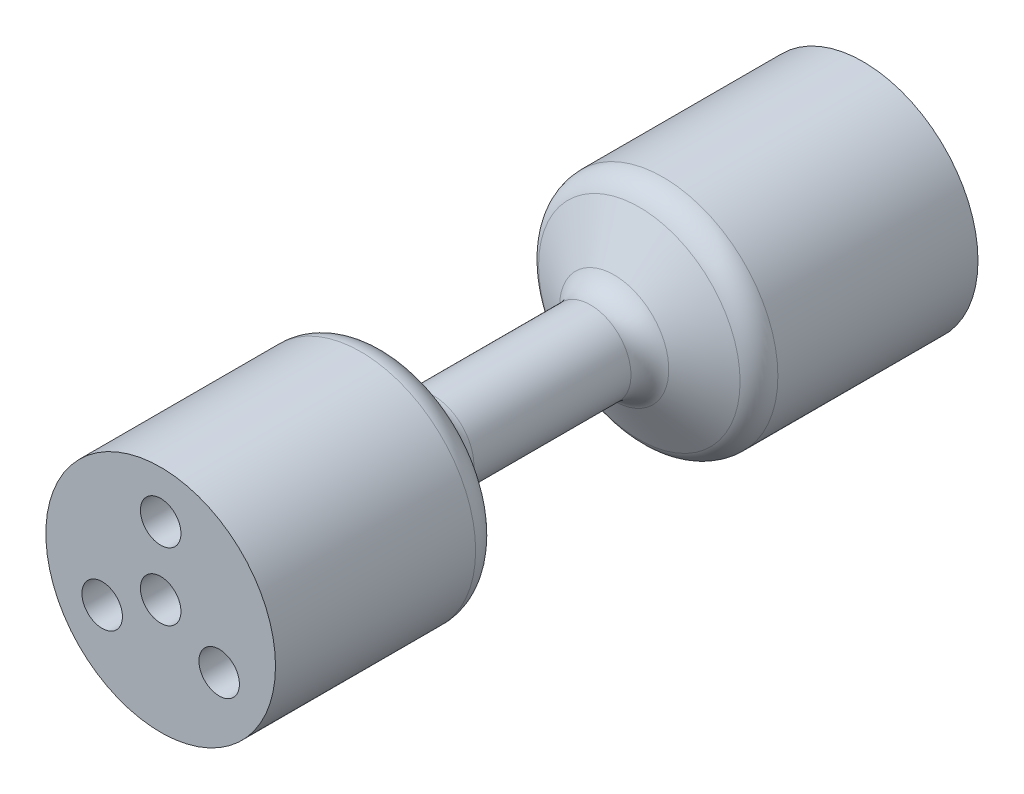
ISO-10303-21;
HEADER;
FILE_DESCRIPTION(('STEP AP214'),'2;1');
FILE_NAME('part.step','',(''),(''),'','','');
FILE_SCHEMA(('AUTOMOTIVE_DESIGN { 1 0 10303 214 1 1 1 1 }'));
ENDSEC;
DATA;
#1=APPLICATION_CONTEXT('core data for automotive mechanical design processes');
#2=APPLICATION_PROTOCOL_DEFINITION('international standard','automotive_design',2000,#1);
#3=PRODUCT_CONTEXT('',#1,'mechanical');
#4=PRODUCT('Part','Part','',(#3));
#5=PRODUCT_RELATED_PRODUCT_CATEGORY('part','',(#4));
#6=PRODUCT_DEFINITION_FORMATION('','',#4);
#7=PRODUCT_DEFINITION_CONTEXT('part definition',#1,'design');
#8=PRODUCT_DEFINITION('design','',#6,#7);
#9=PRODUCT_DEFINITION_SHAPE('','',#8);
#10=(LENGTH_UNIT() NAMED_UNIT(*) SI_UNIT(.MILLI.,.METRE.));
#11=(NAMED_UNIT(*) PLANE_ANGLE_UNIT() SI_UNIT($,.RADIAN.));
#12=(NAMED_UNIT(*) SI_UNIT($,.STERADIAN.) SOLID_ANGLE_UNIT());
#13=UNCERTAINTY_MEASURE_WITH_UNIT(LENGTH_MEASURE(1.E-05),#10,'distance_accuracy_value','');
#14=(GEOMETRIC_REPRESENTATION_CONTEXT(3) GLOBAL_UNCERTAINTY_ASSIGNED_CONTEXT((#13)) GLOBAL_UNIT_ASSIGNED_CONTEXT((#10,
#11,#12)) REPRESENTATION_CONTEXT('',''));
#15=CARTESIAN_POINT('',(0.,0.,0.));
#16=DIRECTION('',(0.,0.,1.));
#17=DIRECTION('',(1.,0.,0.));
#18=AXIS2_PLACEMENT_3D('',#15,#16,#17);
#19=CARTESIAN_POINT('',(0.,0.,-26.));
#20=DIRECTION('',(0.,0.,1.));
#21=DIRECTION('',(1.,0.,0.));
#22=AXIS2_PLACEMENT_3D('',#19,#20,#21);
#23=CYLINDRICAL_SURFACE('',#22,8.5);
#24=CARTESIAN_POINT('',(0.,0.,26.));
#25=DIRECTION('',(0.,0.,1.));
#26=DIRECTION('',(1.,0.,0.));
#27=AXIS2_PLACEMENT_3D('',#24,#25,#26);
#28=CIRCLE('',#27,8.5);
#29=CARTESIAN_POINT('',(8.5,0.,26.));
#30=VERTEX_POINT('',#29);
#31=EDGE_CURVE('E221',#30,#30,#28,.T.);
#32=ORIENTED_EDGE('',*,*,#31,.F.);
#33=EDGE_LOOP('',(#32));
#34=FACE_BOUND('',#33,.T.);
#35=CARTESIAN_POINT('',(0.,0.,11.1872661974803));
#36=DIRECTION('',(0.,0.,1.));
#37=DIRECTION('',(1.,0.,0.));
#38=AXIS2_PLACEMENT_3D('',#35,#36,#37);
#39=CIRCLE('',#38,8.5);
#40=CARTESIAN_POINT('',(8.5,0.,11.1872661974803));
#41=VERTEX_POINT('',#40);
#42=EDGE_CURVE('E12',#41,#41,#39,.T.);
#43=ORIENTED_EDGE('',*,*,#42,.T.);
#44=EDGE_LOOP('',(#43));
#45=FACE_BOUND('',#44,.T.);
#46=CARTESIAN_POINT('',(1.49332949286116,-8.36779343828175,14.7872661974803));
#47=CARTESIAN_POINT('',(1.49320077292687,-8.36781640984236,14.9863625743715));
#48=CARTESIAN_POINT('',(1.45593974164716,-8.37472843837975,15.1771276389204));
#49=CARTESIAN_POINT('',(1.30516877304622,-8.39954590568914,15.5455927399329));
#50=CARTESIAN_POINT('',(1.19836473161887,-8.41628036307572,15.7074170280104));
#51=CARTESIAN_POINT('',(0.918755932610781,-8.45137507842212,15.9885254569623));
#52=CARTESIAN_POINT('',(0.757689252871574,-8.46816872314455,16.0965883343585));
#53=CARTESIAN_POINT('',(0.389886530355396,-8.49305381008551,16.2489604505911));
#54=CARTESIAN_POINT('',(0.199356043893647,-8.49999948653378,16.2870360096817));
#55=CARTESIAN_POINT('',(-0.19931225588046,-8.50000051340983,16.2869652197791));
#56=CARTESIAN_POINT('',(-0.390197353717225,-8.49303207455775,16.2491241653273));
#57=CARTESIAN_POINT('',(-0.757313533559261,-8.46819484932903,16.0965806602115));
#58=CARTESIAN_POINT('',(-0.91849836710609,-8.45140425520101,15.9885532787485));
#59=CARTESIAN_POINT('',(-1.19824843269259,-8.41629810717016,15.7070330614148));
#60=CARTESIAN_POINT('',(-1.30539061251455,-8.39950791598466,15.5449777734616));
#61=CARTESIAN_POINT('',(-1.45539726299671,-8.37481920334952,15.1776054335189));
#62=CARTESIAN_POINT('',(-1.4928785010296,-8.36787391324485,14.9858091621965));
#63=CARTESIAN_POINT('',(-1.49330444006786,-8.36779791200013,14.5884277288241));
#64=CARTESIAN_POINT('',(-1.45567673201202,-8.37477204539171,14.3966217778712));
#65=CARTESIAN_POINT('',(-1.30536339506055,-8.39951355539305,14.0295595219438));
#66=CARTESIAN_POINT('',(-1.19765403300475,-8.41637359716597,13.866917384349));
#67=CARTESIAN_POINT('',(-0.918985706498862,-8.45134219997604,13.586196793426));
#68=CARTESIAN_POINT('',(-0.756746922633022,-8.46823480627482,13.477597953289));
#69=CARTESIAN_POINT('',(-0.390614254837772,-8.49300224555701,13.3257261163328));
#70=CARTESIAN_POINT('',(-0.198439710295903,-8.50000330899419,13.2877109449996));
#71=CARTESIAN_POINT('',(0.198723085159996,-8.499996688644,13.2875242765838));
#72=CARTESIAN_POINT('',(0.390875785371489,-8.49299064598984,13.3258464571734));
#73=CARTESIAN_POINT('',(0.757047614380403,-8.46820836434849,13.4774581621797));
#74=CARTESIAN_POINT('',(0.919017527831042,-8.45134284903115,13.5862341417105));
#75=CARTESIAN_POINT('',(1.12838566918774,-8.42506338692205,13.7968018778415));
#76=CARTESIAN_POINT('',(1.19008827991209,-8.4164501827975,13.8724404576655));
#77=CARTESIAN_POINT('',(1.29743377941897,-8.40057196752214,14.0346162862075));
#78=CARTESIAN_POINT('',(1.34362322320899,-8.39321703271982,14.1224860666553));
#79=CARTESIAN_POINT('',(1.41787072328118,-8.38099386328057,14.3037941695261));
#80=CARTESIAN_POINT('',(1.44589221537894,-8.37614281119899,14.3975183066449));
#81=CARTESIAN_POINT('',(1.48392496216112,-8.36948859840128,14.5916408031886));
#82=CARTESIAN_POINT('',(1.49339385282831,-8.36778195250144,14.6877180090347));
#83=CARTESIAN_POINT('',(1.49332949286116,-8.36779343828175,14.7872661974803));
#84=B_SPLINE_CURVE_WITH_KNOTS('',3,(#46,#47,#48,#49,#50,#51,#52,#53,#54,#55,#56,#57,#58,#59,#60,
#61,#62,#63,#64,#65,#66,#67,#68,#69,#70,#71,#72,#73,#74,#75,#76,#77,#78,#79,#80,#81,#82,#83),
.UNSPECIFIED.,.T.,.F.,(4,2,2,2,2,2,2,2,2,2,2,2,2,2,2,2,2,2,4),(0.,0.0625,0.125,0.1875,0.25,
0.3125,0.375,0.4375,0.5,0.5625,0.625,0.6875,0.75,0.8125,0.875,0.90625,0.9375,0.96875,1.),.UNSPECIFIED.);
#85=CARTESIAN_POINT('',(1.49332949286116,-8.36779343828175,14.7872661974803));
#86=VERTEX_POINT('',#85);
#87=EDGE_CURVE('E224',#86,#86,#84,.T.);
#88=ORIENTED_EDGE('',*,*,#87,.F.);
#89=EDGE_LOOP('',(#88));
#90=FACE_BOUND('',#89,.T.);
#91=ADVANCED_FACE('F157',(#34,#45,#90),#23,.T.);
#92=CARTESIAN_POINT('',(0.,0.,-26.));
#93=DIRECTION('',(0.,0.,1.));
#94=DIRECTION('',(1.,0.,0.));
#95=AXIS2_PLACEMENT_3D('',#92,#93,#94);
#96=CIRCLE('',#95,8.5);
#97=CARTESIAN_POINT('',(8.5,0.,-26.));
#98=VERTEX_POINT('',#97);
#99=EDGE_CURVE('E339',#98,#98,#96,.T.);
#100=ORIENTED_EDGE('',*,*,#99,.T.);
#101=EDGE_LOOP('',(#100));
#102=FACE_BOUND('',#101,.T.);
#103=CARTESIAN_POINT('',(0.,0.,-11.1872661974803));
#104=DIRECTION('',(0.,0.,1.));
#105=DIRECTION('',(1.,0.,0.));
#106=AXIS2_PLACEMENT_3D('',#103,#104,#105);
#107=CIRCLE('',#106,8.5);
#108=CARTESIAN_POINT('',(8.5,0.,-11.1872661974803));
#109=VERTEX_POINT('',#108);
#110=EDGE_CURVE('E342',#109,#109,#107,.F.);
#111=ORIENTED_EDGE('',*,*,#110,.T.);
#112=EDGE_LOOP('',(#111));
#113=FACE_BOUND('',#112,.T.);
#114=CARTESIAN_POINT('',(1.4931181344637,-8.36783115487733,-14.1872661974803));
#115=CARTESIAN_POINT('',(1.49306248216078,-8.36784108522382,-13.9881406986235));
#116=CARTESIAN_POINT('',(1.45555752529808,-8.37479302682736,-13.7967508177317));
#117=CARTESIAN_POINT('',(1.3051868760339,-8.39954124760852,-13.4295661964944));
#118=CARTESIAN_POINT('',(1.19788025343674,-8.41634831881446,-13.267357827716));
#119=CARTESIAN_POINT('',(0.9183898093226,-8.45141386297683,-12.9859851422204));
#120=CARTESIAN_POINT('',(0.75690587087002,-8.4682264536657,-12.877618192523));
#121=CARTESIAN_POINT('',(0.390234251442477,-8.49302555023368,-12.7255029899182));
#122=CARTESIAN_POINT('',(0.198556472236748,-8.50000679898275,-12.6874964215123));
#123=CARTESIAN_POINT('',(-0.199138161238625,-8.49999319106543,-12.6875849993441));
#124=CARTESIAN_POINT('',(-0.390408268486887,-8.49302573907051,-12.7255828696081));
#125=CARTESIAN_POINT('',(-0.757832504296225,-8.46815178867557,-12.8778213233675));
#126=CARTESIAN_POINT('',(-0.919460273273915,-8.45129230384802,-12.9861567180744));
#127=CARTESIAN_POINT('',(-1.19833167059312,-8.41627886933788,-13.2668533059465));
#128=CARTESIAN_POINT('',(-1.3055776650063,-8.39948129862992,-13.4292705030596));
#129=CARTESIAN_POINT('',(-1.41848247320001,-8.38089268840579,-13.7051325834634));
#130=CARTESIAN_POINT('',(-1.44667793222646,-8.37600664633941,-13.798949624178));
#131=CARTESIAN_POINT('',(-1.48428367274597,-8.36942449383067,-13.9903097334339));
#132=CARTESIAN_POINT('',(-1.49369491576316,-8.36772821618084,-14.0893627783874));
#133=CARTESIAN_POINT('',(-1.49376440403705,-8.36771581176592,-14.2851549904718));
#134=CARTESIAN_POINT('',(-1.48416075617528,-8.36944685132175,-14.3830666263401));
#135=CARTESIAN_POINT('',(-1.44607437408106,-8.37611142785818,-14.5767229315726));
#136=CARTESIAN_POINT('',(-1.41848002745862,-8.38089318166385,-14.6693460146397));
#137=CARTESIAN_POINT('',(-1.30552360009611,-8.39949001860388,-14.9453138625382));
#138=CARTESIAN_POINT('',(-1.19833167019202,-8.41627986710815,-15.1075416704383));
#139=CARTESIAN_POINT('',(-0.919341477472461,-8.45130622099767,-15.3884240389793));
#140=CARTESIAN_POINT('',(-0.757590504847613,-8.4681684014545,-15.4968009405692));
#141=CARTESIAN_POINT('',(-0.390629115928727,-8.4930105582306,-15.6489119549535));
#142=CARTESIAN_POINT('',(-0.199250359820964,-8.49999359106147,-15.6869570325963));
#143=CARTESIAN_POINT('',(0.198703174822323,-8.50000640013232,-15.6870263583951));
#144=CARTESIAN_POINT('',(0.390160635733516,-8.49303074441404,-15.6489916187671));
#145=CARTESIAN_POINT('',(0.756999308568397,-8.46821991885338,-15.4968942864123));
#146=CARTESIAN_POINT('',(0.918566551544898,-8.45139298768841,-15.3885030140396));
#147=CARTESIAN_POINT('',(1.12803517812514,-8.42511060001017,-15.1776429445888));
#148=CARTESIAN_POINT('',(1.1897520213265,-8.41649768913825,-15.1019526552277));
#149=CARTESIAN_POINT('',(1.29708777225961,-8.40062536568407,-14.939764877417));
#150=CARTESIAN_POINT('',(1.34321170223919,-8.39328289257041,-14.8520360272821));
#151=CARTESIAN_POINT('',(1.41745632800827,-8.38106395095138,-14.6706965746653));
#152=CARTESIAN_POINT('',(1.44548426344682,-8.3762133551096,-14.577048199622));
#153=CARTESIAN_POINT('',(1.48363111283088,-8.36954082654652,-14.3828253617912));
#154=CARTESIAN_POINT('',(1.49314596061516,-8.36782618970409,-14.2868289469087));
#155=CARTESIAN_POINT('',(1.4931181344637,-8.36783115487733,-14.1872661974803));
#156=B_SPLINE_CURVE_WITH_KNOTS('',3,(#114,#115,#116,#117,#118,#119,#120,#121,#122,#123,#124,
#125,#126,#127,#128,#129,#130,#131,#132,#133,#134,#135,#136,#137,#138,#139,#140,#141,#142,#143,
#144,#145,#146,#147,#148,#149,#150,#151,#152,#153,#154,#155),.UNSPECIFIED.,.T.,.F.,(4,2,2,2,2,2,
2,2,2,2,2,2,2,2,2,2,2,2,2,2,4),(0.,0.0625,0.125,0.1875,0.25,0.3125,0.375,0.4375,0.46875,0.5,
0.53125,0.5625,0.625,0.6875,0.75,0.8125,0.875,0.90625,0.9375,0.96875,1.),.UNSPECIFIED.);
#157=CARTESIAN_POINT('',(1.4931181344637,-8.36783115487733,-14.1872661974803));
#158=VERTEX_POINT('',#157);
#159=EDGE_CURVE('E180',#158,#158,#156,.T.);
#160=ORIENTED_EDGE('',*,*,#159,.F.);
#161=EDGE_LOOP('',(#160));
#162=FACE_BOUND('',#161,.T.);
#163=ADVANCED_FACE('F184',(#102,#113,#162),#23,.T.);
#164=CARTESIAN_POINT('',(0.,0.,26.));
#165=DIRECTION('',(0.,0.,1.));
#166=DIRECTION('',(1.,0.,0.));
#167=AXIS2_PLACEMENT_3D('',#164,#165,#166);
#168=PLANE('',#167);
#169=CARTESIAN_POINT('',(0.,5.,26.));
#170=DIRECTION('',(0.,0.,-1.));
#171=DIRECTION('',(-1.,0.,0.));
#172=AXIS2_PLACEMENT_3D('',#169,#170,#171);
#173=CIRCLE('',#172,1.5);
#174=CARTESIAN_POINT('',(-1.5,5.,26.));
#175=VERTEX_POINT('',#174);
#176=EDGE_CURVE('E388',#175,#175,#173,.T.);
#177=ORIENTED_EDGE('',*,*,#176,.T.);
#178=EDGE_LOOP('',(#177));
#179=FACE_BOUND('',#178,.T.);
#180=CARTESIAN_POINT('',(-4.33012701892251,-2.49999999999982,26.));
#181=DIRECTION('',(0.,0.,-1.));
#182=DIRECTION('',(-1.,0.,0.));
#183=AXIS2_PLACEMENT_3D('',#180,#181,#182);
#184=CIRCLE('',#183,1.50000000000027);
#185=CARTESIAN_POINT('',(-5.83012701892279,-2.49999999999982,26.));
#186=VERTEX_POINT('',#185);
#187=EDGE_CURVE('E392',#186,#186,#184,.T.);
#188=ORIENTED_EDGE('',*,*,#187,.T.);
#189=EDGE_LOOP('',(#188));
#190=FACE_BOUND('',#189,.T.);
#191=CARTESIAN_POINT('',(4.33012701892187,-2.50000000000019,26.));
#192=DIRECTION('',(0.,0.,-1.));
#193=DIRECTION('',(-1.,0.,0.));
#194=AXIS2_PLACEMENT_3D('',#191,#192,#193);
#195=CIRCLE('',#194,1.5000000000004);
#196=CARTESIAN_POINT('',(2.83012701892147,-2.50000000000019,26.));
#197=VERTEX_POINT('',#196);
#198=EDGE_CURVE('E395',#197,#197,#195,.T.);
#199=ORIENTED_EDGE('',*,*,#198,.T.);
#200=EDGE_LOOP('',(#199));
#201=FACE_BOUND('',#200,.T.);
#202=CARTESIAN_POINT('',(0.,0.,26.));
#203=DIRECTION('',(0.,0.,1.));
#204=DIRECTION('',(1.,0.,0.));
#205=AXIS2_PLACEMENT_3D('',#202,#203,#204);
#206=CIRCLE('',#205,1.5);
#207=CARTESIAN_POINT('',(1.5,0.,26.));
#208=VERTEX_POINT('',#207);
#209=EDGE_CURVE('E236',#208,#208,#206,.F.);
#210=ORIENTED_EDGE('',*,*,#209,.T.);
#211=EDGE_LOOP('',(#210));
#212=FACE_BOUND('',#211,.T.);
#213=ORIENTED_EDGE('',*,*,#31,.T.);
#214=EDGE_LOOP('',(#213));
#215=FACE_BOUND('',#214,.T.);
#216=ADVANCED_FACE('F194',(#179,#190,#201,#212,#215),#168,.T.);
#217=CARTESIAN_POINT('',(0.,0.,10.));
#218=DIRECTION('',(0.,0.,1.));
#219=DIRECTION('',(1.,0.,0.));
#220=AXIS2_PLACEMENT_3D('',#217,#218,#219);
#221=CONICAL_SURFACE('',#220,8.5,1.07144960511477);
#222=CARTESIAN_POINT('',(0.,0.,9.43147505165154));
#223=DIRECTION('',(0.,0.,1.));
#224=DIRECTION('',(1.,0.,0.));
#225=AXIS2_PLACEMENT_3D('',#222,#223,#224);
#226=CIRCLE('',#225,7.45770426136115);
#227=CARTESIAN_POINT('',(7.45770426136115,0.,9.43147505165154));
#228=VERTEX_POINT('',#227);
#229=EDGE_CURVE('E167',#228,#228,#226,.F.);
#230=ORIENTED_EDGE('',*,*,#229,.T.);
#231=EDGE_LOOP('',(#230));
#232=FACE_BOUND('',#231,.T.);
#233=CARTESIAN_POINT('',(0.,0.,7.56852494834847));
#234=DIRECTION('',(0.,0.,1.));
#235=DIRECTION('',(1.,0.,0.));
#236=AXIS2_PLACEMENT_3D('',#233,#234,#235);
#237=CIRCLE('',#236,4.04229573863885);
#238=CARTESIAN_POINT('',(4.04229573863885,0.,7.56852494834847));
#239=VERTEX_POINT('',#238);
#240=EDGE_CURVE('E172',#239,#239,#237,.T.);
#241=ORIENTED_EDGE('',*,*,#240,.T.);
#242=EDGE_LOOP('',(#241));
#243=FACE_BOUND('',#242,.T.);
#244=ADVANCED_FACE('F359',(#232,#243),#221,.T.);
#245=CARTESIAN_POINT('',(0.,0.,-7.));
#246=DIRECTION('',(0.,0.,-1.));
#247=DIRECTION('',(-1.,0.,0.));
#248=AXIS2_PLACEMENT_3D('',#245,#246,#247);
#249=CONICAL_SURFACE('',#248,3.,1.07144960511477);
#250=CARTESIAN_POINT('',(0.,0.,-9.43147505165153));
#251=DIRECTION('',(0.,0.,-1.));
#252=DIRECTION('',(-1.,0.,0.));
#253=AXIS2_PLACEMENT_3D('',#250,#251,#252);
#254=CIRCLE('',#253,7.45770426136115);
#255=CARTESIAN_POINT('',(-7.45770426136115,0.,-9.43147505165153));
#256=VERTEX_POINT('',#255);
#257=EDGE_CURVE('E348',#256,#256,#254,.F.);
#258=ORIENTED_EDGE('',*,*,#257,.T.);
#259=EDGE_LOOP('',(#258));
#260=FACE_BOUND('',#259,.T.);
#261=CARTESIAN_POINT('',(0.,0.,-7.56852494834847));
#262=DIRECTION('',(0.,0.,-1.));
#263=DIRECTION('',(-1.,0.,0.));
#264=AXIS2_PLACEMENT_3D('',#261,#262,#263);
#265=CIRCLE('',#264,4.04229573863885);
#266=CARTESIAN_POINT('',(-4.04229573863885,0.,-7.56852494834847));
#267=VERTEX_POINT('',#266);
#268=EDGE_CURVE('E345',#267,#267,#265,.T.);
#269=ORIENTED_EDGE('',*,*,#268,.T.);
#270=EDGE_LOOP('',(#269));
#271=FACE_BOUND('',#270,.T.);
#272=ADVANCED_FACE('F364',(#260,#271),#249,.T.);
#273=CARTESIAN_POINT('',(0.,0.,-22.));
#274=DIRECTION('',(0.,0.,-1.));
#275=DIRECTION('',(-1.,0.,0.));
#276=AXIS2_PLACEMENT_3D('',#273,#274,#275);
#277=CYLINDRICAL_SURFACE('',#276,3.);
#278=CARTESIAN_POINT('',(0.,0.,-5.8127338025197));
#279=DIRECTION('',(0.,0.,-1.));
#280=DIRECTION('',(-1.,0.,0.));
#281=AXIS2_PLACEMENT_3D('',#278,#279,#280);
#282=CIRCLE('',#281,3.);
#283=CARTESIAN_POINT('',(-3.,0.,-5.8127338025197));
#284=VERTEX_POINT('',#283);
#285=EDGE_CURVE('E354',#284,#284,#282,.F.);
#286=ORIENTED_EDGE('',*,*,#285,.T.);
#287=EDGE_LOOP('',(#286));
#288=FACE_BOUND('',#287,.T.);
#289=CARTESIAN_POINT('',(0.,0.,5.8127338025197));
#290=DIRECTION('',(0.,0.,-1.));
#291=DIRECTION('',(-1.,0.,0.));
#292=AXIS2_PLACEMENT_3D('',#289,#290,#291);
#293=CIRCLE('',#292,3.);
#294=CARTESIAN_POINT('',(-3.,0.,5.8127338025197));
#295=VERTEX_POINT('',#294);
#296=EDGE_CURVE('E351',#295,#295,#293,.T.);
#297=ORIENTED_EDGE('',*,*,#296,.T.);
#298=EDGE_LOOP('',(#297));
#299=FACE_BOUND('',#298,.T.);
#300=ADVANCED_FACE('F322',(#288,#299),#277,.T.);
#301=CARTESIAN_POINT('',(0.,0.,-26.));
#302=DIRECTION('',(0.,0.,1.));
#303=DIRECTION('',(1.,0.,0.));
#304=AXIS2_PLACEMENT_3D('',#301,#302,#303);
#305=PLANE('',#304);
#306=CARTESIAN_POINT('',(0.,5.,-26.));
#307=DIRECTION('',(0.,0.,-1.));
#308=DIRECTION('',(-1.,0.,0.));
#309=AXIS2_PLACEMENT_3D('',#306,#307,#308);
#310=CIRCLE('',#309,1.5);
#311=CARTESIAN_POINT('',(-1.5,5.,-26.));
#312=VERTEX_POINT('',#311);
#313=EDGE_CURVE('E406',#312,#312,#310,.T.);
#314=ORIENTED_EDGE('',*,*,#313,.F.);
#315=EDGE_LOOP('',(#314));
#316=FACE_BOUND('',#315,.T.);
#317=CARTESIAN_POINT('',(-4.33012701892251,-2.49999999999982,-26.));
#318=DIRECTION('',(0.,0.,-1.));
#319=DIRECTION('',(-1.,0.,0.));
#320=AXIS2_PLACEMENT_3D('',#317,#318,#319);
#321=CIRCLE('',#320,1.50000000000027);
#322=CARTESIAN_POINT('',(-5.83012701892279,-2.49999999999982,-26.));
#323=VERTEX_POINT('',#322);
#324=EDGE_CURVE('E412',#323,#323,#321,.T.);
#325=ORIENTED_EDGE('',*,*,#324,.F.);
#326=EDGE_LOOP('',(#325));
#327=FACE_BOUND('',#326,.T.);
#328=CARTESIAN_POINT('',(4.33012701892187,-2.50000000000019,-26.));
#329=DIRECTION('',(0.,0.,-1.));
#330=DIRECTION('',(-1.,0.,0.));
#331=AXIS2_PLACEMENT_3D('',#328,#329,#330);
#332=CIRCLE('',#331,1.5000000000004);
#333=CARTESIAN_POINT('',(2.83012701892147,-2.50000000000019,-26.));
#334=VERTEX_POINT('',#333);
#335=EDGE_CURVE('E417',#334,#334,#332,.T.);
#336=ORIENTED_EDGE('',*,*,#335,.F.);
#337=EDGE_LOOP('',(#336));
#338=FACE_BOUND('',#337,.T.);
#339=CARTESIAN_POINT('',(0.,0.,-26.));
#340=DIRECTION('',(0.,0.,-1.));
#341=DIRECTION('',(-1.,0.,0.));
#342=AXIS2_PLACEMENT_3D('',#339,#340,#341);
#343=CIRCLE('',#342,1.5);
#344=CARTESIAN_POINT('',(-1.5,0.,-26.));
#345=VERTEX_POINT('',#344);
#346=EDGE_CURVE('E243',#345,#345,#343,.T.);
#347=ORIENTED_EDGE('',*,*,#346,.F.);
#348=EDGE_LOOP('',(#347));
#349=FACE_BOUND('',#348,.T.);
#350=ORIENTED_EDGE('',*,*,#99,.F.);
#351=EDGE_LOOP('',(#350));
#352=FACE_BOUND('',#351,.T.);
#353=ADVANCED_FACE('F196',(#316,#327,#338,#349,#352),#305,.F.);
#354=CARTESIAN_POINT('',(0.,0.,-11.1872661974803));
#355=DIRECTION('',(0.,0.,1.));
#356=DIRECTION('',(1.,0.,0.));
#357=AXIS2_PLACEMENT_3D('',#354,#355,#356);
#358=TOROIDAL_SURFACE('',#357,6.5,2.);
#359=ORIENTED_EDGE('',*,*,#257,.F.);
#360=EDGE_LOOP('',(#359));
#361=FACE_BOUND('',#360,.T.);
#362=ORIENTED_EDGE('',*,*,#110,.F.);
#363=EDGE_LOOP('',(#362));
#364=FACE_BOUND('',#363,.T.);
#365=ADVANCED_FACE('F198',(#361,#364),#358,.T.);
#366=CARTESIAN_POINT('',(0.,0.,-5.8127338025197));
#367=DIRECTION('',(0.,0.,-1.));
#368=DIRECTION('',(-1.,0.,0.));
#369=AXIS2_PLACEMENT_3D('',#366,#367,#368);
#370=TOROIDAL_SURFACE('',#369,5.,2.);
#371=ORIENTED_EDGE('',*,*,#285,.F.);
#372=EDGE_LOOP('',(#371));
#373=FACE_BOUND('',#372,.T.);
#374=ORIENTED_EDGE('',*,*,#268,.F.);
#375=EDGE_LOOP('',(#374));
#376=FACE_BOUND('',#375,.T.);
#377=ADVANCED_FACE('F202',(#373,#376),#370,.F.);
#378=CARTESIAN_POINT('',(0.,0.,11.1872661974803));
#379=DIRECTION('',(0.,0.,1.));
#380=DIRECTION('',(1.,0.,0.));
#381=AXIS2_PLACEMENT_3D('',#378,#379,#380);
#382=TOROIDAL_SURFACE('',#381,6.5,2.);
#383=ORIENTED_EDGE('',*,*,#42,.F.);
#384=EDGE_LOOP('',(#383));
#385=FACE_BOUND('',#384,.T.);
#386=ORIENTED_EDGE('',*,*,#229,.F.);
#387=EDGE_LOOP('',(#386));
#388=FACE_BOUND('',#387,.T.);
#389=ADVANCED_FACE('F205',(#385,#388),#382,.T.);
#390=CARTESIAN_POINT('',(0.,0.,5.8127338025197));
#391=DIRECTION('',(0.,0.,-1.));
#392=DIRECTION('',(-1.,0.,0.));
#393=AXIS2_PLACEMENT_3D('',#390,#391,#392);
#394=TOROIDAL_SURFACE('',#393,5.,2.);
#395=ORIENTED_EDGE('',*,*,#240,.F.);
#396=EDGE_LOOP('',(#395));
#397=FACE_BOUND('',#396,.T.);
#398=ORIENTED_EDGE('',*,*,#296,.F.);
#399=EDGE_LOOP('',(#398));
#400=FACE_BOUND('',#399,.T.);
#401=ADVANCED_FACE('F159',(#397,#400),#394,.F.);
#402=CARTESIAN_POINT('',(1.4931181344637,-8.36783115487733,-14.1872661974803));
#403=CARTESIAN_POINT('',(1.49306248216078,-8.36784108522382,-13.9881406986235));
#404=CARTESIAN_POINT('',(1.45555752529808,-8.37479302682736,-13.7967508177317));
#405=CARTESIAN_POINT('',(1.3051868760339,-8.39954124760852,-13.4295661964944));
#406=CARTESIAN_POINT('',(1.19788025343674,-8.41634831881446,-13.267357827716));
#407=CARTESIAN_POINT('',(0.9183898093226,-8.45141386297683,-12.9859851422204));
#408=CARTESIAN_POINT('',(0.75690587087002,-8.4682264536657,-12.877618192523));
#409=CARTESIAN_POINT('',(0.390234251442477,-8.49302555023368,-12.7255029899182));
#410=CARTESIAN_POINT('',(0.198556472236748,-8.50000679898275,-12.6874964215123));
#411=CARTESIAN_POINT('',(-0.199138161238625,-8.49999319106543,-12.6875849993441));
#412=CARTESIAN_POINT('',(-0.390408268486887,-8.49302573907051,-12.7255828696081));
#413=CARTESIAN_POINT('',(-0.757832504296225,-8.46815178867557,-12.8778213233675));
#414=CARTESIAN_POINT('',(-0.919460273273915,-8.45129230384802,-12.9861567180744));
#415=CARTESIAN_POINT('',(-1.19833167059312,-8.41627886933788,-13.2668533059465));
#416=CARTESIAN_POINT('',(-1.3055776650063,-8.39948129862992,-13.4292705030596));
#417=CARTESIAN_POINT('',(-1.41848247320001,-8.38089268840579,-13.7051325834634));
#418=CARTESIAN_POINT('',(-1.44667793222646,-8.37600664633941,-13.798949624178));
#419=CARTESIAN_POINT('',(-1.48428367274597,-8.36942449383067,-13.9903097334339));
#420=CARTESIAN_POINT('',(-1.49369491576316,-8.36772821618084,-14.0893627783874));
#421=CARTESIAN_POINT('',(-1.49376440403705,-8.36771581176592,-14.2851549904718));
#422=CARTESIAN_POINT('',(-1.48416075617528,-8.36944685132175,-14.3830666263401));
#423=CARTESIAN_POINT('',(-1.44607437408106,-8.37611142785818,-14.5767229315726));
#424=CARTESIAN_POINT('',(-1.41848002745862,-8.38089318166385,-14.6693460146397));
#425=CARTESIAN_POINT('',(-1.30552360009611,-8.39949001860388,-14.9453138625382));
#426=CARTESIAN_POINT('',(-1.19833167019202,-8.41627986710815,-15.1075416704383));
#427=CARTESIAN_POINT('',(-0.919341477472461,-8.45130622099767,-15.3884240389793));
#428=CARTESIAN_POINT('',(-0.757590504847613,-8.4681684014545,-15.4968009405692));
#429=CARTESIAN_POINT('',(-0.390629115928727,-8.4930105582306,-15.6489119549535));
#430=CARTESIAN_POINT('',(-0.199250359820964,-8.49999359106147,-15.6869570325963));
#431=CARTESIAN_POINT('',(0.198703174822323,-8.50000640013232,-15.6870263583951));
#432=CARTESIAN_POINT('',(0.390160635733516,-8.49303074441404,-15.6489916187671));
#433=CARTESIAN_POINT('',(0.756999308568397,-8.46821991885338,-15.4968942864123));
#434=CARTESIAN_POINT('',(0.918566551544898,-8.45139298768841,-15.3885030140396));
#435=CARTESIAN_POINT('',(1.12803517812514,-8.42511060001017,-15.1776429445888));
#436=CARTESIAN_POINT('',(1.1897520213265,-8.41649768913825,-15.1019526552277));
#437=CARTESIAN_POINT('',(1.29708777225961,-8.40062536568407,-14.939764877417));
#438=CARTESIAN_POINT('',(1.34321170223919,-8.39328289257041,-14.8520360272821));
#439=CARTESIAN_POINT('',(1.41745632800827,-8.38106395095138,-14.6706965746653));
#440=CARTESIAN_POINT('',(1.44548426344682,-8.3762133551096,-14.577048199622));
#441=CARTESIAN_POINT('',(1.48363111283088,-8.36954082654652,-14.3828253617912));
#442=CARTESIAN_POINT('',(1.49314596061516,-8.36782618970409,-14.2868289469087));
#443=CARTESIAN_POINT('',(1.4931181344637,-8.36783115487733,-14.1872661974803));
#444=CARTESIAN_POINT('',(0.966135263476509,-5.41447898256769,-14.1872661974803));
#445=CARTESIAN_POINT('',(0.966099253162855,-5.414485408086,-13.9881406986235));
#446=CARTESIAN_POINT('',(0.941831339898756,-5.41898372324123,-13.7967508177317));
#447=CARTESIAN_POINT('',(0.844532684492521,-5.43499727786434,-13.4295661964944));
#448=CARTESIAN_POINT('',(0.775098987517894,-5.44587244158582,-13.267357827716));
#449=CARTESIAN_POINT('',(0.594252229561682,-5.46856191133795,-12.9859851422204));
#450=CARTESIAN_POINT('',(0.48976262232766,-5.47944064648957,-12.877618192523));
#451=CARTESIAN_POINT('',(0.25250451563925,-5.49548712073944,-12.7255029899182));
#452=CARTESIAN_POINT('',(0.128477717329661,-5.50000439934178,-12.6874964215123));
#453=CARTESIAN_POINT('',(-0.128854104330875,-5.49999559421881,-12.6875849993441));
#454=CARTESIAN_POINT('',(-0.25261711490328,-5.49548724292798,-12.7255828696081));
#455=CARTESIAN_POINT('',(-0.490362208662263,-5.47939233384889,-12.8778213233675));
#456=CARTESIAN_POINT('',(-0.594944882706651,-5.46848325543107,-12.9861567180744));
#457=CARTESIAN_POINT('',(-0.775391080972019,-5.44582750368922,-13.2668533059465));
#458=CARTESIAN_POINT('',(-0.844785547945256,-5.43495848734877,-13.4292705030596));
#459=CARTESIAN_POINT('',(-0.917841600305891,-5.4229305630861,-13.7051325834634));
#460=CARTESIAN_POINT('',(-0.936085720852418,-5.41976900645491,-13.798949624178));
#461=CARTESIAN_POINT('',(-0.960418847070919,-5.41550996659631,-13.9903097334339));
#462=CARTESIAN_POINT('',(-0.966508474905572,-5.41441237517583,-14.0893627783874));
#463=CARTESIAN_POINT('',(-0.966553437906324,-5.41440434878972,-14.2851549904718));
#464=CARTESIAN_POINT('',(-0.9603393128193,-5.41552443320819,-14.3830666263401));
#465=CARTESIAN_POINT('',(-0.935695183228924,-5.41983680626118,-14.5767229315726));
#466=CARTESIAN_POINT('',(-0.91784001776734,-5.42293088225308,-14.6693460146397));
#467=CARTESIAN_POINT('',(-0.844750564768068,-5.43496412968486,-14.9453138625382));
#468=CARTESIAN_POINT('',(-0.775391080712483,-5.44582814930527,-15.1075416704383));
#469=CARTESIAN_POINT('',(-0.594868014835122,-5.46849226064555,-15.3884240389793));
#470=CARTESIAN_POINT('',(-0.49020562078375,-5.47940308329408,-15.4968009405692));
#471=CARTESIAN_POINT('',(-0.252760016189176,-5.49547742003156,-15.6489119549535));
#472=CARTESIAN_POINT('',(-0.128926703413565,-5.49999585303977,-15.6869570325963));
#473=CARTESIAN_POINT('',(0.128572642532092,-5.50000414126209,-15.6870263583951));
#474=CARTESIAN_POINT('',(0.252456881945216,-5.49549048167967,-15.6489916187671));
#475=CARTESIAN_POINT('',(0.489823082014845,-5.47943641808159,-15.4968942864123));
#476=CARTESIAN_POINT('',(0.59436659217611,-5.46854840379839,-15.3885030140396));
#477=CARTESIAN_POINT('',(0.72990511525744,-5.45154215294776,-15.1776429445888));
#478=CARTESIAN_POINT('',(0.769839543211262,-5.44596909297181,-15.1019526552277));
#479=CARTESIAN_POINT('',(0.839292087932688,-5.43569876603087,-14.939764877417));
#480=CARTESIAN_POINT('',(0.869136983801831,-5.43094775401615,-14.8520360272821));
#481=CARTESIAN_POINT('',(0.917177624005349,-5.42304138002737,-14.6706965746653));
#482=CARTESIAN_POINT('',(0.935313346936177,-5.41990275918857,-14.577048199622));
#483=CARTESIAN_POINT('',(0.959996602419979,-5.41558524070657,-14.3828253617912));
#484=CARTESIAN_POINT('',(0.966153268633336,-5.41447576980853,-14.2868289469087));
#485=CARTESIAN_POINT('',(0.966135263476509,-5.41447898256769,-14.1872661974803));
#486=B_SPLINE_SURFACE_WITH_KNOTS('',1,3,((#402,#403,#404,#405,#406,#407,#408,#409,#410,#411,
#412,#413,#414,#415,#416,#417,#418,#419,#420,#421,#422,#423,#424,#425,#426,#427,#428,#429,#430,
#431,#432,#433,#434,#435,#436,#437,#438,#439,#440,#441,#442,#443),(#444,#445,#446,#447,#448,
#449,#450,#451,#452,#453,#454,#455,#456,#457,#458,#459,#460,#461,#462,#463,#464,#465,#466,#467,
#468,#469,#470,#471,#472,#473,#474,#475,#476,#477,#478,#479,#480,#481,#482,#483,#484,#485)),
.UNSPECIFIED.,.F.,.T.,.F.,(2,2),(4,2,2,2,2,2,2,2,2,2,2,2,2,2,2,2,2,2,2,2,4),(0.,1.),(0.,0.0625,
0.125,0.1875,0.25,0.3125,0.375,0.4375,0.46875,0.5,0.53125,0.5625,0.625,0.6875,0.75,0.8125,0.875,
0.90625,0.9375,0.96875,1.),.UNSPECIFIED.);
#487=CARTESIAN_POINT('',(0.966135263476509,-5.41447898256769,-14.1872661974803));
#488=CARTESIAN_POINT('',(0.966153268633336,-5.41447576980853,-14.2868289469087));
#489=CARTESIAN_POINT('',(0.959996602419979,-5.41558524070657,-14.3828253617912));
#490=CARTESIAN_POINT('',(0.935313346936177,-5.41990275918857,-14.577048199622));
#491=CARTESIAN_POINT('',(0.917177624005349,-5.42304138002737,-14.6706965746653));
#492=CARTESIAN_POINT('',(0.869136983801831,-5.43094775401615,-14.8520360272821));
#493=CARTESIAN_POINT('',(0.839292087932688,-5.43569876603087,-14.939764877417));
#494=CARTESIAN_POINT('',(0.769839543211262,-5.44596909297181,-15.1019526552277));
#495=CARTESIAN_POINT('',(0.72990511525744,-5.45154215294776,-15.1776429445888));
#496=CARTESIAN_POINT('',(0.59436659217611,-5.46854840379839,-15.3885030140396));
#497=CARTESIAN_POINT('',(0.489823082014845,-5.47943641808159,-15.4968942864123));
#498=CARTESIAN_POINT('',(0.252456881945216,-5.49549048167967,-15.6489916187671));
#499=CARTESIAN_POINT('',(0.128572642532092,-5.50000414126209,-15.6870263583951));
#500=CARTESIAN_POINT('',(-0.128926703413565,-5.49999585303977,-15.6869570325963));
#501=CARTESIAN_POINT('',(-0.252760016189176,-5.49547742003156,-15.6489119549535));
#502=CARTESIAN_POINT('',(-0.49020562078375,-5.47940308329408,-15.4968009405692));
#503=CARTESIAN_POINT('',(-0.594868014835122,-5.46849226064555,-15.3884240389793));
#504=CARTESIAN_POINT('',(-0.775391080712483,-5.44582814930527,-15.1075416704383));
#505=CARTESIAN_POINT('',(-0.844750564768068,-5.43496412968486,-14.9453138625382));
#506=CARTESIAN_POINT('',(-0.91784001776734,-5.42293088225308,-14.6693460146397));
#507=CARTESIAN_POINT('',(-0.935695183228924,-5.41983680626118,-14.5767229315726));
#508=CARTESIAN_POINT('',(-0.9603393128193,-5.41552443320819,-14.3830666263401));
#509=CARTESIAN_POINT('',(-0.966553437906324,-5.41440434878972,-14.2851549904718));
#510=CARTESIAN_POINT('',(-0.966508474905572,-5.41441237517583,-14.0893627783874));
#511=CARTESIAN_POINT('',(-0.960418847070919,-5.41550996659631,-13.9903097334339));
#512=CARTESIAN_POINT('',(-0.936085720852418,-5.41976900645491,-13.798949624178));
#513=CARTESIAN_POINT('',(-0.917841600305891,-5.4229305630861,-13.7051325834634));
#514=CARTESIAN_POINT('',(-0.844785547945256,-5.43495848734877,-13.4292705030596));
#515=CARTESIAN_POINT('',(-0.775391080972019,-5.44582750368922,-13.2668533059465));
#516=CARTESIAN_POINT('',(-0.594944882706651,-5.46848325543107,-12.9861567180744));
#517=CARTESIAN_POINT('',(-0.490362208662263,-5.47939233384889,-12.8778213233675));
#518=CARTESIAN_POINT('',(-0.25261711490328,-5.49548724292798,-12.7255828696081));
#519=CARTESIAN_POINT('',(-0.128854104330875,-5.49999559421881,-12.6875849993441));
#520=CARTESIAN_POINT('',(0.128477717329661,-5.50000439934178,-12.6874964215123));
#521=CARTESIAN_POINT('',(0.25250451563925,-5.49548712073944,-12.7255029899182));
#522=CARTESIAN_POINT('',(0.48976262232766,-5.47944064648957,-12.877618192523));
#523=CARTESIAN_POINT('',(0.594252229561682,-5.46856191133795,-12.9859851422204));
#524=CARTESIAN_POINT('',(0.775098987517894,-5.44587244158582,-13.267357827716));
#525=CARTESIAN_POINT('',(0.844532684492521,-5.43499727786434,-13.4295661964944));
#526=CARTESIAN_POINT('',(0.941831339898756,-5.41898372324123,-13.7967508177317));
#527=CARTESIAN_POINT('',(0.966099253162855,-5.414485408086,-13.9881406986235));
#528=CARTESIAN_POINT('',(0.966135263476509,-5.41447898256769,-14.1872661974803));
#529=B_SPLINE_CURVE_WITH_KNOTS('',3,(#487,#488,#489,#490,#491,#492,#493,#494,#495,#496,#497,
#498,#499,#500,#501,#502,#503,#504,#505,#506,#507,#508,#509,#510,#511,#512,#513,#514,#515,#516,
#517,#518,#519,#520,#521,#522,#523,#524,#525,#526,#527,#528),.UNSPECIFIED.,.T.,.F.,(4,2,2,2,2,2,
2,2,2,2,2,2,2,2,2,2,2,2,2,2,4),(0.,0.03125,0.0625,0.09375,0.125,0.1875,0.25,0.3125,0.375,0.4375,
0.46875,0.5,0.53125,0.5625,0.625,0.6875,0.75,0.8125,0.875,0.9375,1.),.UNSPECIFIED.);
#530=CARTESIAN_POINT('',(0.966135263476509,-5.41447898256769,-14.1872661974803));
#531=VERTEX_POINT('',#530);
#532=EDGE_CURVE('E228',#531,#531,#529,.F.);
#533=ORIENTED_EDGE('',*,*,#159,.T.);
#534=EDGE_LOOP('',(#533));
#535=FACE_BOUND('',#534,.T.);
#536=ORIENTED_EDGE('',*,*,#532,.F.);
#537=EDGE_LOOP('',(#536));
#538=FACE_BOUND('',#537,.T.);
#539=ADVANCED_FACE('F212',(#535,#538),#486,.F.);
#540=CARTESIAN_POINT('',(0.,0.,-26.));
#541=DIRECTION('',(0.,0.,1.));
#542=DIRECTION('',(1.,0.,0.));
#543=AXIS2_PLACEMENT_3D('',#540,#541,#542);
#544=CYLINDRICAL_SURFACE('',#543,5.5);
#545=ORIENTED_EDGE('',*,*,#532,.T.);
#546=EDGE_LOOP('',(#545));
#547=FACE_BOUND('',#546,.T.);
#548=ADVANCED_FACE('F274',(#547),#544,.T.);
#549=CARTESIAN_POINT('',(1.49332949286116,-8.36779343828175,14.7872661974803));
#550=CARTESIAN_POINT('',(1.49320077292687,-8.36781640984236,14.9863625743715));
#551=CARTESIAN_POINT('',(1.45593974164716,-8.37472843837975,15.1771276389204));
#552=CARTESIAN_POINT('',(1.30516877304622,-8.39954590568914,15.5455927399329));
#553=CARTESIAN_POINT('',(1.19836473161887,-8.41628036307572,15.7074170280104));
#554=CARTESIAN_POINT('',(0.918755932610781,-8.45137507842212,15.9885254569623));
#555=CARTESIAN_POINT('',(0.757689252871574,-8.46816872314455,16.0965883343585));
#556=CARTESIAN_POINT('',(0.389886530355396,-8.49305381008551,16.2489604505911));
#557=CARTESIAN_POINT('',(0.199356043893647,-8.49999948653378,16.2870360096817));
#558=CARTESIAN_POINT('',(-0.19931225588046,-8.50000051340983,16.2869652197791));
#559=CARTESIAN_POINT('',(-0.390197353717225,-8.49303207455775,16.2491241653273));
#560=CARTESIAN_POINT('',(-0.757313533559261,-8.46819484932903,16.0965806602115));
#561=CARTESIAN_POINT('',(-0.91849836710609,-8.45140425520101,15.9885532787485));
#562=CARTESIAN_POINT('',(-1.19824843269259,-8.41629810717016,15.7070330614148));
#563=CARTESIAN_POINT('',(-1.30539061251455,-8.39950791598466,15.5449777734616));
#564=CARTESIAN_POINT('',(-1.45539726299671,-8.37481920334952,15.1776054335189));
#565=CARTESIAN_POINT('',(-1.4928785010296,-8.36787391324485,14.9858091621965));
#566=CARTESIAN_POINT('',(-1.49330444006786,-8.36779791200013,14.5884277288241));
#567=CARTESIAN_POINT('',(-1.45567673201202,-8.37477204539171,14.3966217778712));
#568=CARTESIAN_POINT('',(-1.30536339506055,-8.39951355539305,14.0295595219438));
#569=CARTESIAN_POINT('',(-1.19765403300475,-8.41637359716597,13.866917384349));
#570=CARTESIAN_POINT('',(-0.918985706498862,-8.45134219997604,13.586196793426));
#571=CARTESIAN_POINT('',(-0.756746922633022,-8.46823480627482,13.477597953289));
#572=CARTESIAN_POINT('',(-0.390614254837772,-8.49300224555701,13.3257261163328));
#573=CARTESIAN_POINT('',(-0.198439710295903,-8.50000330899419,13.2877109449996));
#574=CARTESIAN_POINT('',(0.198723085159996,-8.499996688644,13.2875242765838));
#575=CARTESIAN_POINT('',(0.390875785371489,-8.49299064598984,13.3258464571734));
#576=CARTESIAN_POINT('',(0.757047614380403,-8.46820836434849,13.4774581621797));
#577=CARTESIAN_POINT('',(0.919017527831042,-8.45134284903115,13.5862341417105));
#578=CARTESIAN_POINT('',(1.12838566918774,-8.42506338692205,13.7968018778415));
#579=CARTESIAN_POINT('',(1.19008827991209,-8.4164501827975,13.8724404576655));
#580=CARTESIAN_POINT('',(1.29743377941897,-8.40057196752214,14.0346162862075));
#581=CARTESIAN_POINT('',(1.34362322320899,-8.39321703271982,14.1224860666553));
#582=CARTESIAN_POINT('',(1.41787072328118,-8.38099386328057,14.3037941695261));
#583=CARTESIAN_POINT('',(1.44589221537894,-8.37614281119899,14.3975183066449));
#584=CARTESIAN_POINT('',(1.48392496216112,-8.36948859840128,14.5916408031886));
#585=CARTESIAN_POINT('',(1.49339385282831,-8.36778195250144,14.6877180090347));
#586=CARTESIAN_POINT('',(1.49332949286116,-8.36779343828175,14.7872661974803));
#587=CARTESIAN_POINT('',(0.966272024792516,-5.41445457771172,14.7872661974803));
#588=CARTESIAN_POINT('',(0.966188735423267,-5.41446944166271,14.9863625743715));
#589=CARTESIAN_POINT('',(0.942078656359924,-5.41894193071631,15.1771276389204));
#590=CARTESIAN_POINT('',(0.844520970794612,-5.4350002919165,15.5455927399329));
#591=CARTESIAN_POINT('',(0.775412473400444,-5.44582847022547,15.7074170280104));
#592=CARTESIAN_POINT('',(0.594489132865799,-5.46853681544961,15.9885254569623));
#593=CARTESIAN_POINT('',(0.490269516563959,-5.47940329144647,16.0965883343585));
#594=CARTESIAN_POINT('',(0.252279519641727,-5.49550540652592,16.2489604505911));
#595=CARTESIAN_POINT('',(0.128995087225301,-5.49999966775715,16.2870360096817));
#596=CARTESIAN_POINT('',(-0.128966753805003,-5.50000033220636,16.2869652197791));
#597=CARTESIAN_POINT('',(-0.252480640640557,-5.4954913423609,16.2491241653273));
#598=CARTESIAN_POINT('',(-0.490026404067757,-5.47942019662467,16.0965806602115));
#599=CARTESIAN_POINT('',(-0.594322472833352,-5.46855569454183,15.9885532787485));
#600=CARTESIAN_POINT('',(-0.775337221154026,-5.44583995169834,15.7070330614148));
#601=CARTESIAN_POINT('',(-0.844664513980002,-5.43497571034302,15.5449777734616));
#602=CARTESIAN_POINT('',(-0.941727640762578,-5.41900066099086,15.1776054335189));
#603=CARTESIAN_POINT('',(-0.965980206548564,-5.41450664974667,14.9858091621965));
#604=CARTESIAN_POINT('',(-0.966255814161555,-5.41445747247067,14.5884277288241));
#605=CARTESIAN_POINT('',(-0.941908473654835,-5.41897014701817,14.3966217778712));
#606=CARTESIAN_POINT('',(-0.844646902686235,-5.43497935937198,14.0295595219438));
#607=CARTESIAN_POINT('',(-0.77495260959131,-5.44588879816622,13.866917384349));
#608=CARTESIAN_POINT('',(-0.594637810087499,-5.46851554116097,13.586196793426));
#609=CARTESIAN_POINT('',(-0.489659773468426,-5.479446051119,13.477597953289));
#610=CARTESIAN_POINT('',(-0.252750400189147,-5.49547204124277,13.3257261163328));
#611=CARTESIAN_POINT('',(-0.128402165485585,-5.50000214111389,13.2877109449996));
#612=CARTESIAN_POINT('',(0.128585525691762,-5.49999785735788,13.2875242765838));
#613=CARTESIAN_POINT('',(0.252919625828611,-5.49546453564049,13.3258464571734));
#614=CARTESIAN_POINT('',(0.489854338716732,-5.47942894163726,13.4774581621797));
#615=CARTESIAN_POINT('',(0.594658400361263,-5.4685159611378,13.5862341417105));
#616=CARTESIAN_POINT('',(0.730131903592066,-5.4515116033025,13.7968018778415));
#617=CARTESIAN_POINT('',(0.770057122296059,-5.44593835357485,13.8724404576655));
#618=CARTESIAN_POINT('',(0.839515974918158,-5.43566421427903,14.0346162862075));
#619=CARTESIAN_POINT('',(0.869403262076407,-5.4309051388187,14.1224860666553));
#620=CARTESIAN_POINT('',(0.917445762123118,-5.42299602918155,14.3037941695261));
#621=CARTESIAN_POINT('',(0.935577315833433,-5.41985711312876,14.3975183066449));
#622=CARTESIAN_POINT('',(0.9601867402219,-5.41555144602436,14.5916408031886));
#623=CARTESIAN_POINT('',(0.966313669477141,-5.41444714573622,14.6877180090347));
#624=CARTESIAN_POINT('',(0.966272024792516,-5.41445457771172,14.7872661974803));
#625=B_SPLINE_SURFACE_WITH_KNOTS('',1,3,((#549,#550,#551,#552,#553,#554,#555,#556,#557,#558,
#559,#560,#561,#562,#563,#564,#565,#566,#567,#568,#569,#570,#571,#572,#573,#574,#575,#576,#577,
#578,#579,#580,#581,#582,#583,#584,#585,#586),(#587,#588,#589,#590,#591,#592,#593,#594,#595,
#596,#597,#598,#599,#600,#601,#602,#603,#604,#605,#606,#607,#608,#609,#610,#611,#612,#613,#614,
#615,#616,#617,#618,#619,#620,#621,#622,#623,#624)),.UNSPECIFIED.,.F.,.T.,.F.,(2,2),(4,2,2,2,2,
2,2,2,2,2,2,2,2,2,2,2,2,2,4),(0.,1.),(0.,0.0625,0.125,0.1875,0.25,0.3125,0.375,0.4375,0.5,
0.5625,0.625,0.6875,0.75,0.8125,0.875,0.90625,0.9375,0.96875,1.),.UNSPECIFIED.);
#626=CARTESIAN_POINT('',(0.966272024792516,-5.41445457771172,14.7872661974803));
#627=CARTESIAN_POINT('',(0.966313669477141,-5.41444714573622,14.6877180090347));
#628=CARTESIAN_POINT('',(0.9601867402219,-5.41555144602436,14.5916408031886));
#629=CARTESIAN_POINT('',(0.935577315833433,-5.41985711312876,14.3975183066449));
#630=CARTESIAN_POINT('',(0.917445762123118,-5.42299602918155,14.3037941695261));
#631=CARTESIAN_POINT('',(0.869403262076407,-5.4309051388187,14.1224860666553));
#632=CARTESIAN_POINT('',(0.839515974918158,-5.43566421427903,14.0346162862075));
#633=CARTESIAN_POINT('',(0.770057122296059,-5.44593835357485,13.8724404576655));
#634=CARTESIAN_POINT('',(0.730131903592066,-5.4515116033025,13.7968018778415));
#635=CARTESIAN_POINT('',(0.594658400361263,-5.4685159611378,13.5862341417105));
#636=CARTESIAN_POINT('',(0.489854338716732,-5.47942894163726,13.4774581621797));
#637=CARTESIAN_POINT('',(0.252919625828611,-5.49546453564049,13.3258464571734));
#638=CARTESIAN_POINT('',(0.128585525691762,-5.49999785735788,13.2875242765838));
#639=CARTESIAN_POINT('',(-0.128402165485585,-5.50000214111389,13.2877109449996));
#640=CARTESIAN_POINT('',(-0.252750400189147,-5.49547204124277,13.3257261163328));
#641=CARTESIAN_POINT('',(-0.489659773468426,-5.479446051119,13.477597953289));
#642=CARTESIAN_POINT('',(-0.594637810087499,-5.46851554116097,13.586196793426));
#643=CARTESIAN_POINT('',(-0.77495260959131,-5.44588879816622,13.866917384349));
#644=CARTESIAN_POINT('',(-0.844646902686235,-5.43497935937198,14.0295595219438));
#645=CARTESIAN_POINT('',(-0.941908473654835,-5.41897014701817,14.3966217778712));
#646=CARTESIAN_POINT('',(-0.966255814161555,-5.41445747247067,14.5884277288241));
#647=CARTESIAN_POINT('',(-0.965980206548564,-5.41450664974667,14.9858091621965));
#648=CARTESIAN_POINT('',(-0.941727640762578,-5.41900066099086,15.1776054335189));
#649=CARTESIAN_POINT('',(-0.844664513980002,-5.43497571034302,15.5449777734616));
#650=CARTESIAN_POINT('',(-0.775337221154026,-5.44583995169834,15.7070330614148));
#651=CARTESIAN_POINT('',(-0.594322472833352,-5.46855569454183,15.9885532787485));
#652=CARTESIAN_POINT('',(-0.490026404067757,-5.47942019662467,16.0965806602115));
#653=CARTESIAN_POINT('',(-0.252480640640557,-5.4954913423609,16.2491241653273));
#654=CARTESIAN_POINT('',(-0.128966753805003,-5.50000033220636,16.2869652197791));
#655=CARTESIAN_POINT('',(0.128995087225301,-5.49999966775715,16.2870360096817));
#656=CARTESIAN_POINT('',(0.252279519641727,-5.49550540652592,16.2489604505911));
#657=CARTESIAN_POINT('',(0.490269516563959,-5.47940329144647,16.0965883343585));
#658=CARTESIAN_POINT('',(0.594489132865799,-5.46853681544961,15.9885254569623));
#659=CARTESIAN_POINT('',(0.775412473400444,-5.44582847022547,15.7074170280104));
#660=CARTESIAN_POINT('',(0.844520970794612,-5.4350002919165,15.5455927399329));
#661=CARTESIAN_POINT('',(0.942078656359924,-5.41894193071631,15.1771276389204));
#662=CARTESIAN_POINT('',(0.966188735423267,-5.41446944166271,14.9863625743715));
#663=CARTESIAN_POINT('',(0.966272024792516,-5.41445457771172,14.7872661974803));
#664=B_SPLINE_CURVE_WITH_KNOTS('',3,(#626,#627,#628,#629,#630,#631,#632,#633,#634,#635,#636,
#637,#638,#639,#640,#641,#642,#643,#644,#645,#646,#647,#648,#649,#650,#651,#652,#653,#654,#655,
#656,#657,#658,#659,#660,#661,#662,#663),.UNSPECIFIED.,.T.,.F.,(4,2,2,2,2,2,2,2,2,2,2,2,2,2,2,2,
2,2,4),(0.,0.03125,0.0625,0.09375,0.125,0.1875,0.25,0.3125,0.375,0.4375,0.5,0.5625,0.625,0.6875,
0.75,0.8125,0.875,0.9375,1.),.UNSPECIFIED.);
#665=CARTESIAN_POINT('',(0.966272024792516,-5.41445457771172,14.7872661974803));
#666=VERTEX_POINT('',#665);
#667=EDGE_CURVE('E229',#666,#666,#664,.F.);
#668=ORIENTED_EDGE('',*,*,#87,.T.);
#669=EDGE_LOOP('',(#668));
#670=FACE_BOUND('',#669,.T.);
#671=ORIENTED_EDGE('',*,*,#667,.F.);
#672=EDGE_LOOP('',(#671));
#673=FACE_BOUND('',#672,.T.);
#674=ADVANCED_FACE('F267',(#670,#673),#625,.F.);
#675=CARTESIAN_POINT('',(0.,0.,-26.));
#676=DIRECTION('',(0.,0.,1.));
#677=DIRECTION('',(1.,0.,0.));
#678=AXIS2_PLACEMENT_3D('',#675,#676,#677);
#679=CYLINDRICAL_SURFACE('',#678,5.5);
#680=ORIENTED_EDGE('',*,*,#667,.T.);
#681=EDGE_LOOP('',(#680));
#682=FACE_BOUND('',#681,.T.);
#683=ADVANCED_FACE('F256',(#682),#679,.T.);
#684=CARTESIAN_POINT('',(0.,0.,30.2426406871193));
#685=DIRECTION('',(0.,0.,-1.));
#686=DIRECTION('',(-1.,0.,0.));
#687=AXIS2_PLACEMENT_3D('',#684,#685,#686);
#688=CYLINDRICAL_SURFACE('',#687,1.5);
#689=ORIENTED_EDGE('',*,*,#346,.T.);
#690=EDGE_LOOP('',(#689));
#691=FACE_BOUND('',#690,.T.);
#692=ORIENTED_EDGE('',*,*,#209,.F.);
#693=EDGE_LOOP('',(#692));
#694=FACE_BOUND('',#693,.T.);
#695=ADVANCED_FACE('F266',(#691,#694),#688,.F.);
#696=CARTESIAN_POINT('',(4.33012701892187,-2.50000000000019,-20.));
#697=DIRECTION('',(0.,0.,-1.));
#698=DIRECTION('',(-1.,0.,0.));
#699=AXIS2_PLACEMENT_3D('',#696,#697,#698);
#700=CYLINDRICAL_SURFACE('',#699,1.5000000000004);
#701=CARTESIAN_POINT('',(4.33012701892187,-2.50000000000019,-20.));
#702=DIRECTION('',(0.,0.,-1.));
#703=DIRECTION('',(-1.,0.,0.));
#704=AXIS2_PLACEMENT_3D('',#701,#702,#703);
#705=CIRCLE('',#704,1.5000000000004);
#706=CARTESIAN_POINT('',(2.83012701892147,-2.50000000000019,-20.));
#707=VERTEX_POINT('',#706);
#708=EDGE_CURVE('E415',#707,#707,#705,.T.);
#709=ORIENTED_EDGE('',*,*,#708,.F.);
#710=EDGE_LOOP('',(#709));
#711=FACE_BOUND('',#710,.T.);
#712=ORIENTED_EDGE('',*,*,#335,.T.);
#713=EDGE_LOOP('',(#712));
#714=FACE_BOUND('',#713,.T.);
#715=ADVANCED_FACE('F474',(#711,#714),#700,.F.);
#716=CARTESIAN_POINT('',(4.33012701892187,-2.50000000000019,-20.));
#717=DIRECTION('',(0.,0.,-1.));
#718=DIRECTION('',(-1.,0.,0.));
#719=AXIS2_PLACEMENT_3D('',#716,#717,#718);
#720=PLANE('',#719);
#721=ORIENTED_EDGE('',*,*,#708,.T.);
#722=EDGE_LOOP('',(#721));
#723=FACE_BOUND('',#722,.T.);
#724=ADVANCED_FACE('F471',(#723),#720,.T.);
#725=CARTESIAN_POINT('',(-4.33012701892251,-2.49999999999982,-20.));
#726=DIRECTION('',(0.,0.,-1.));
#727=DIRECTION('',(-1.,0.,0.));
#728=AXIS2_PLACEMENT_3D('',#725,#726,#727);
#729=CYLINDRICAL_SURFACE('',#728,1.50000000000027);
#730=CARTESIAN_POINT('',(-4.33012701892251,-2.49999999999982,-20.));
#731=DIRECTION('',(0.,0.,-1.));
#732=DIRECTION('',(-1.,0.,0.));
#733=AXIS2_PLACEMENT_3D('',#730,#731,#732);
#734=CIRCLE('',#733,1.50000000000027);
#735=CARTESIAN_POINT('',(-5.83012701892279,-2.49999999999982,-20.));
#736=VERTEX_POINT('',#735);
#737=EDGE_CURVE('E409',#736,#736,#734,.T.);
#738=ORIENTED_EDGE('',*,*,#737,.F.);
#739=EDGE_LOOP('',(#738));
#740=FACE_BOUND('',#739,.T.);
#741=ORIENTED_EDGE('',*,*,#324,.T.);
#742=EDGE_LOOP('',(#741));
#743=FACE_BOUND('',#742,.T.);
#744=ADVANCED_FACE('F467',(#740,#743),#729,.F.);
#745=CARTESIAN_POINT('',(-4.33012701892251,-2.49999999999982,-20.));
#746=DIRECTION('',(0.,0.,-1.));
#747=DIRECTION('',(-1.,0.,0.));
#748=AXIS2_PLACEMENT_3D('',#745,#746,#747);
#749=PLANE('',#748);
#750=ORIENTED_EDGE('',*,*,#737,.T.);
#751=EDGE_LOOP('',(#750));
#752=FACE_BOUND('',#751,.T.);
#753=ADVANCED_FACE('F463',(#752),#749,.T.);
#754=CARTESIAN_POINT('',(0.,5.,-20.));
#755=DIRECTION('',(0.,0.,-1.));
#756=DIRECTION('',(-1.,0.,0.));
#757=AXIS2_PLACEMENT_3D('',#754,#755,#756);
#758=CYLINDRICAL_SURFACE('',#757,1.5);
#759=CARTESIAN_POINT('',(0.,5.,-20.));
#760=DIRECTION('',(0.,0.,-1.));
#761=DIRECTION('',(-1.,0.,0.));
#762=AXIS2_PLACEMENT_3D('',#759,#760,#761);
#763=CIRCLE('',#762,1.5);
#764=CARTESIAN_POINT('',(-1.5,5.,-20.));
#765=VERTEX_POINT('',#764);
#766=EDGE_CURVE('E248',#765,#765,#763,.T.);
#767=ORIENTED_EDGE('',*,*,#766,.F.);
#768=EDGE_LOOP('',(#767));
#769=FACE_BOUND('',#768,.T.);
#770=ORIENTED_EDGE('',*,*,#313,.T.);
#771=EDGE_LOOP('',(#770));
#772=FACE_BOUND('',#771,.T.);
#773=ADVANCED_FACE('F459',(#769,#772),#758,.F.);
#774=CARTESIAN_POINT('',(0.,5.,-20.));
#775=DIRECTION('',(0.,0.,-1.));
#776=DIRECTION('',(-1.,0.,0.));
#777=AXIS2_PLACEMENT_3D('',#774,#775,#776);
#778=PLANE('',#777);
#779=ORIENTED_EDGE('',*,*,#766,.T.);
#780=EDGE_LOOP('',(#779));
#781=FACE_BOUND('',#780,.T.);
#782=ADVANCED_FACE('F455',(#781),#778,.T.);
#783=CARTESIAN_POINT('',(4.33012701892187,-2.50000000000019,20.));
#784=DIRECTION('',(0.,0.,1.));
#785=DIRECTION('',(1.,0.,0.));
#786=AXIS2_PLACEMENT_3D('',#783,#784,#785);
#787=CYLINDRICAL_SURFACE('',#786,1.5000000000004);
#788=CARTESIAN_POINT('',(4.33012701892187,-2.50000000000019,20.));
#789=DIRECTION('',(0.,0.,-1.));
#790=DIRECTION('',(-1.,0.,0.));
#791=AXIS2_PLACEMENT_3D('',#788,#789,#790);
#792=CIRCLE('',#791,1.5000000000004);
#793=CARTESIAN_POINT('',(2.83012701892147,-2.50000000000019,20.));
#794=VERTEX_POINT('',#793);
#795=EDGE_CURVE('E398',#794,#794,#792,.T.);
#796=ORIENTED_EDGE('',*,*,#795,.T.);
#797=EDGE_LOOP('',(#796));
#798=FACE_BOUND('',#797,.T.);
#799=ORIENTED_EDGE('',*,*,#198,.F.);
#800=EDGE_LOOP('',(#799));
#801=FACE_BOUND('',#800,.T.);
#802=ADVANCED_FACE('F451',(#798,#801),#787,.F.);
#803=CARTESIAN_POINT('',(4.33012701892187,-2.50000000000019,20.));
#804=DIRECTION('',(0.,0.,1.));
#805=DIRECTION('',(-1.,0.,0.));
#806=AXIS2_PLACEMENT_3D('',#803,#804,#805);
#807=PLANE('',#806);
#808=ORIENTED_EDGE('',*,*,#795,.F.);
#809=EDGE_LOOP('',(#808));
#810=FACE_BOUND('',#809,.T.);
#811=ADVANCED_FACE('F445',(#810),#807,.T.);
#812=CARTESIAN_POINT('',(-4.33012701892251,-2.49999999999982,20.));
#813=DIRECTION('',(0.,0.,1.));
#814=DIRECTION('',(1.,0.,0.));
#815=AXIS2_PLACEMENT_3D('',#812,#813,#814);
#816=CYLINDRICAL_SURFACE('',#815,1.50000000000027);
#817=CARTESIAN_POINT('',(-4.33012701892251,-2.49999999999982,20.));
#818=DIRECTION('',(0.,0.,-1.));
#819=DIRECTION('',(-1.,0.,0.));
#820=AXIS2_PLACEMENT_3D('',#817,#818,#819);
#821=CIRCLE('',#820,1.50000000000027);
#822=CARTESIAN_POINT('',(-5.83012701892279,-2.49999999999982,20.));
#823=VERTEX_POINT('',#822);
#824=EDGE_CURVE('E426',#823,#823,#821,.T.);
#825=ORIENTED_EDGE('',*,*,#824,.T.);
#826=EDGE_LOOP('',(#825));
#827=FACE_BOUND('',#826,.T.);
#828=ORIENTED_EDGE('',*,*,#187,.F.);
#829=EDGE_LOOP('',(#828));
#830=FACE_BOUND('',#829,.T.);
#831=ADVANCED_FACE('F432',(#827,#830),#816,.F.);
#832=CARTESIAN_POINT('',(-4.33012701892251,-2.49999999999982,20.));
#833=DIRECTION('',(0.,0.,1.));
#834=DIRECTION('',(-1.,0.,0.));
#835=AXIS2_PLACEMENT_3D('',#832,#833,#834);
#836=PLANE('',#835);
#837=ORIENTED_EDGE('',*,*,#824,.F.);
#838=EDGE_LOOP('',(#837));
#839=FACE_BOUND('',#838,.T.);
#840=ADVANCED_FACE('F435',(#839),#836,.T.);
#841=CARTESIAN_POINT('',(0.,5.,20.));
#842=DIRECTION('',(0.,0.,1.));
#843=DIRECTION('',(1.,0.,0.));
#844=AXIS2_PLACEMENT_3D('',#841,#842,#843);
#845=CYLINDRICAL_SURFACE('',#844,1.5);
#846=CARTESIAN_POINT('',(0.,5.,20.));
#847=DIRECTION('',(0.,0.,-1.));
#848=DIRECTION('',(-1.,0.,0.));
#849=AXIS2_PLACEMENT_3D('',#846,#847,#848);
#850=CIRCLE('',#849,1.5);
#851=CARTESIAN_POINT('',(-1.5,5.,20.));
#852=VERTEX_POINT('',#851);
#853=EDGE_CURVE('E419',#852,#852,#850,.T.);
#854=ORIENTED_EDGE('',*,*,#853,.T.);
#855=EDGE_LOOP('',(#854));
#856=FACE_BOUND('',#855,.T.);
#857=ORIENTED_EDGE('',*,*,#176,.F.);
#858=EDGE_LOOP('',(#857));
#859=FACE_BOUND('',#858,.T.);
#860=ADVANCED_FACE('F437',(#856,#859),#845,.F.);
#861=CARTESIAN_POINT('',(0.,5.,20.));
#862=DIRECTION('',(0.,0.,1.));
#863=DIRECTION('',(-1.,0.,0.));
#864=AXIS2_PLACEMENT_3D('',#861,#862,#863);
#865=PLANE('',#864);
#866=ORIENTED_EDGE('',*,*,#853,.F.);
#867=EDGE_LOOP('',(#866));
#868=FACE_BOUND('',#867,.T.);
#869=ADVANCED_FACE('F443',(#868),#865,.T.);
#870=CLOSED_SHELL('',(#91,#163,#216,#244,#272,#300,#353,#365,#377,#389,#401,#539,#548,#674,#683,
#695,#715,#724,#744,#753,#773,#782,#802,#811,#831,#840,#860,#869));
#871=MANIFOLD_SOLID_BREP('B2',#870);
#872=ADVANCED_BREP_SHAPE_REPRESENTATION('',(#18,#871),#14);
#873=SHAPE_DEFINITION_REPRESENTATION(#9,#872);
ENDSEC;
END-ISO-10303-21;
